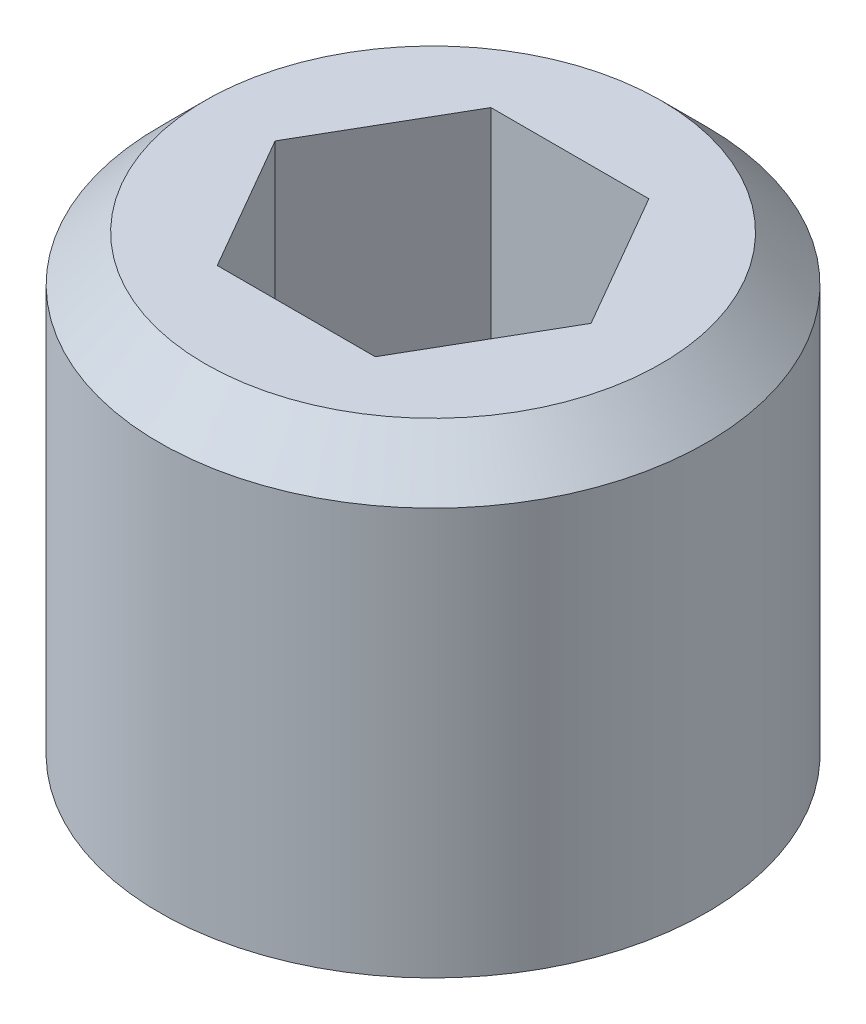
ISO-10303-21;
HEADER;
FILE_DESCRIPTION(('STEP AP214'),'2;1');
FILE_NAME('part.step','',(''),(''),'','','');
FILE_SCHEMA(('AUTOMOTIVE_DESIGN { 1 0 10303 214 1 1 1 1 }'));
ENDSEC;
DATA;
#1=APPLICATION_CONTEXT('core data for automotive mechanical design processes');
#2=APPLICATION_PROTOCOL_DEFINITION('international standard','automotive_design',2000,#1);
#3=PRODUCT_CONTEXT('',#1,'mechanical');
#4=PRODUCT('Part','Part','',(#3));
#5=PRODUCT_RELATED_PRODUCT_CATEGORY('part','',(#4));
#6=PRODUCT_DEFINITION_FORMATION('','',#4);
#7=PRODUCT_DEFINITION_CONTEXT('part definition',#1,'design');
#8=PRODUCT_DEFINITION('design','',#6,#7);
#9=PRODUCT_DEFINITION_SHAPE('','',#8);
#10=(LENGTH_UNIT() NAMED_UNIT(*) SI_UNIT(.MILLI.,.METRE.));
#11=(NAMED_UNIT(*) PLANE_ANGLE_UNIT() SI_UNIT($,.RADIAN.));
#12=(NAMED_UNIT(*) SI_UNIT($,.STERADIAN.) SOLID_ANGLE_UNIT());
#13=UNCERTAINTY_MEASURE_WITH_UNIT(LENGTH_MEASURE(1.E-05),#10,'distance_accuracy_value','');
#14=(GEOMETRIC_REPRESENTATION_CONTEXT(3) GLOBAL_UNCERTAINTY_ASSIGNED_CONTEXT((#13)) GLOBAL_UNIT_ASSIGNED_CONTEXT((#10,
#11,#12)) REPRESENTATION_CONTEXT('',''));
#15=CARTESIAN_POINT('',(0.,0.,0.));
#16=DIRECTION('',(0.,0.,1.));
#17=DIRECTION('',(1.,0.,0.));
#18=AXIS2_PLACEMENT_3D('',#15,#16,#17);
#19=CARTESIAN_POINT('',(0.,3.,0.));
#20=DIRECTION('',(0.,1.,0.));
#21=DIRECTION('',(0.,0.,1.));
#22=AXIS2_PLACEMENT_3D('',#19,#20,#21);
#23=PLANE('',#22);
#24=DIRECTION('',(1.,0.,0.));
#25=VECTOR('',#24,1.);
#26=CARTESIAN_POINT('',(-0.43301270189222,3.,0.75));
#27=LINE('',#26,#25);
#28=CARTESIAN_POINT('',(-0.43301270189222,3.,0.75));
#29=VERTEX_POINT('',#28);
#30=CARTESIAN_POINT('',(0.43301270189222,3.,0.75));
#31=VERTEX_POINT('',#30);
#32=EDGE_CURVE('E44',#29,#31,#27,.T.);
#33=ORIENTED_EDGE('',*,*,#32,.F.);
#34=DIRECTION('',(0.5,0.,0.866025403784439));
#35=VECTOR('',#34,1.);
#36=CARTESIAN_POINT('',(-0.866025403784439,3.,0.));
#37=LINE('',#36,#35);
#38=CARTESIAN_POINT('',(-0.866025403784439,3.,0.));
#39=VERTEX_POINT('',#38);
#40=EDGE_CURVE('E112',#39,#29,#37,.T.);
#41=ORIENTED_EDGE('',*,*,#40,.F.);
#42=DIRECTION('',(-0.5,0.,0.866025403784439));
#43=VECTOR('',#42,1.);
#44=CARTESIAN_POINT('',(-0.433012701892219,3.,-0.75));
#45=LINE('',#44,#43);
#46=CARTESIAN_POINT('',(-0.433012701892219,3.,-0.75));
#47=VERTEX_POINT('',#46);
#48=EDGE_CURVE('E106',#47,#39,#45,.T.);
#49=ORIENTED_EDGE('',*,*,#48,.F.);
#50=DIRECTION('',(-1.,0.,0.));
#51=VECTOR('',#50,1.);
#52=CARTESIAN_POINT('',(0.43301270189222,3.,-0.75));
#53=LINE('',#52,#51);
#54=CARTESIAN_POINT('',(0.43301270189222,3.,-0.75));
#55=VERTEX_POINT('',#54);
#56=EDGE_CURVE('E104',#55,#47,#53,.T.);
#57=ORIENTED_EDGE('',*,*,#56,.F.);
#58=DIRECTION('',(-0.5,0.,-0.866025403784439));
#59=VECTOR('',#58,1.);
#60=CARTESIAN_POINT('',(0.866025403784439,3.,0.));
#61=LINE('',#60,#59);
#62=CARTESIAN_POINT('',(0.866025403784439,3.,0.));
#63=VERTEX_POINT('',#62);
#64=EDGE_CURVE('E86',#63,#55,#61,.T.);
#65=ORIENTED_EDGE('',*,*,#64,.F.);
#66=DIRECTION('',(0.5,0.,-0.866025403784439));
#67=VECTOR('',#66,1.);
#68=CARTESIAN_POINT('',(0.43301270189222,3.,0.75));
#69=LINE('',#68,#67);
#70=EDGE_CURVE('E97',#31,#63,#69,.T.);
#71=ORIENTED_EDGE('',*,*,#70,.F.);
#72=EDGE_LOOP('',(#33,#41,#49,#57,#65,#71));
#73=FACE_BOUND('',#72,.T.);
#74=CARTESIAN_POINT('',(0.,3.,0.));
#75=DIRECTION('',(0.,-1.,0.));
#76=DIRECTION('',(0.,0.,-1.));
#77=AXIS2_PLACEMENT_3D('',#74,#75,#76);
#78=CIRCLE('',#77,1.25);
#79=CARTESIAN_POINT('',(0.,3.,-1.25));
#80=VERTEX_POINT('',#79);
#81=EDGE_CURVE('E132',#80,#80,#78,.T.);
#82=ORIENTED_EDGE('',*,*,#81,.F.);
#83=EDGE_LOOP('',(#82));
#84=FACE_BOUND('',#83,.T.);
#85=ADVANCED_FACE('F30',(#73,#84),#23,.T.);
#86=CARTESIAN_POINT('',(0.,0.34641016151377,0.));
#87=DIRECTION('',(0.,-1.,0.));
#88=DIRECTION('',(0.,0.,-1.));
#89=AXIS2_PLACEMENT_3D('',#86,#87,#88);
#90=CONICAL_SURFACE('',#89,0.,1.0471975511966);
#91=CARTESIAN_POINT('',(0.,0.,0.));
#92=DIRECTION('',(0.,-1.,0.));
#93=DIRECTION('',(0.,0.,-1.));
#94=AXIS2_PLACEMENT_3D('',#91,#92,#93);
#95=CIRCLE('',#94,0.6);
#96=CARTESIAN_POINT('',(0.,0.,-0.6));
#97=VERTEX_POINT('',#96);
#98=EDGE_CURVE('E11',#97,#97,#95,.T.);
#99=ORIENTED_EDGE('',*,*,#98,.T.);
#100=EDGE_LOOP('',(#99));
#101=FACE_BOUND('',#100,.T.);
#102=CARTESIAN_POINT('',(0.,0.346410161513771,0.));
#103=VERTEX_POINT('',#102);
#104=VERTEX_LOOP('',#103);
#105=FACE_BOUND('',#104,.T.);
#106=ADVANCED_FACE('F161',(#101,#105),#90,.F.);
#107=CARTESIAN_POINT('',(0.,0.,0.));
#108=DIRECTION('',(0.,1.,0.));
#109=DIRECTION('',(0.,0.,1.));
#110=AXIS2_PLACEMENT_3D('',#107,#108,#109);
#111=CONICAL_SURFACE('',#110,0.6,1.04719755119659);
#112=CARTESIAN_POINT('',(0.,0.519615242270669,0.));
#113=DIRECTION('',(0.,-1.,0.));
#114=DIRECTION('',(0.,0.,-1.));
#115=AXIS2_PLACEMENT_3D('',#112,#113,#114);
#116=CIRCLE('',#115,1.5);
#117=CARTESIAN_POINT('',(0.,0.519615242270669,-1.5));
#118=VERTEX_POINT('',#117);
#119=EDGE_CURVE('E37',#118,#118,#116,.T.);
#120=ORIENTED_EDGE('',*,*,#119,.T.);
#121=EDGE_LOOP('',(#120));
#122=FACE_BOUND('',#121,.T.);
#123=ORIENTED_EDGE('',*,*,#98,.F.);
#124=EDGE_LOOP('',(#123));
#125=FACE_BOUND('',#124,.T.);
#126=ADVANCED_FACE('F146',(#122,#125),#111,.T.);
#127=CARTESIAN_POINT('',(0.,3.,0.));
#128=DIRECTION('',(0.,-1.,0.));
#129=DIRECTION('',(0.,0.,-1.));
#130=AXIS2_PLACEMENT_3D('',#127,#128,#129);
#131=CYLINDRICAL_SURFACE('',#130,1.5);
#132=CARTESIAN_POINT('',(0.,2.75,0.));
#133=DIRECTION('',(0.,-1.,0.));
#134=DIRECTION('',(0.,0.,-1.));
#135=AXIS2_PLACEMENT_3D('',#132,#133,#134);
#136=CIRCLE('',#135,1.5);
#137=CARTESIAN_POINT('',(0.,2.75,-1.5));
#138=VERTEX_POINT('',#137);
#139=EDGE_CURVE('E141',#138,#138,#136,.T.);
#140=ORIENTED_EDGE('',*,*,#139,.T.);
#141=EDGE_LOOP('',(#140));
#142=FACE_BOUND('',#141,.T.);
#143=ORIENTED_EDGE('',*,*,#119,.F.);
#144=EDGE_LOOP('',(#143));
#145=FACE_BOUND('',#144,.T.);
#146=ADVANCED_FACE('F149',(#142,#145),#131,.T.);
#147=CARTESIAN_POINT('',(0.,2.75,0.));
#148=DIRECTION('',(0.,-1.,0.));
#149=DIRECTION('',(0.,0.,-1.));
#150=AXIS2_PLACEMENT_3D('',#147,#148,#149);
#151=CONICAL_SURFACE('',#150,1.5,0.785398163397448);
#152=ORIENTED_EDGE('',*,*,#81,.T.);
#153=EDGE_LOOP('',(#152));
#154=FACE_BOUND('',#153,.T.);
#155=ORIENTED_EDGE('',*,*,#139,.F.);
#156=EDGE_LOOP('',(#155));
#157=FACE_BOUND('',#156,.T.);
#158=ADVANCED_FACE('F151',(#154,#157),#151,.T.);
#159=CARTESIAN_POINT('',(-0.43301270189222,1.,0.75));
#160=DIRECTION('',(0.,0.,1.));
#161=DIRECTION('',(1.,0.,0.));
#162=AXIS2_PLACEMENT_3D('',#159,#160,#161);
#163=PLANE('',#162);
#164=ORIENTED_EDGE('',*,*,#32,.T.);
#165=DIRECTION('',(0.,1.,0.));
#166=VECTOR('',#165,1.);
#167=CARTESIAN_POINT('',(0.43301270189222,1.,0.75));
#168=LINE('',#167,#166);
#169=CARTESIAN_POINT('',(0.43301270189222,1.,0.75));
#170=VERTEX_POINT('',#169);
#171=EDGE_CURVE('E94',#170,#31,#168,.T.);
#172=ORIENTED_EDGE('',*,*,#171,.F.);
#173=DIRECTION('',(1.,0.,0.));
#174=VECTOR('',#173,1.);
#175=CARTESIAN_POINT('',(-0.43301270189222,1.,0.75));
#176=LINE('',#175,#174);
#177=CARTESIAN_POINT('',(-0.43301270189222,1.,0.75));
#178=VERTEX_POINT('',#177);
#179=EDGE_CURVE('E115',#178,#170,#176,.T.);
#180=ORIENTED_EDGE('',*,*,#179,.F.);
#181=DIRECTION('',(0.,1.,0.));
#182=VECTOR('',#181,1.);
#183=CARTESIAN_POINT('',(-0.43301270189222,1.,0.75));
#184=LINE('',#183,#182);
#185=EDGE_CURVE('E130',#178,#29,#184,.T.);
#186=ORIENTED_EDGE('',*,*,#185,.T.);
#187=EDGE_LOOP('',(#164,#172,#180,#186));
#188=FACE_BOUND('',#187,.T.);
#189=ADVANCED_FACE('F158',(#188),#163,.F.);
#190=CARTESIAN_POINT('',(-0.866025403784439,1.,0.));
#191=DIRECTION('',(-0.866025403784439,0.,0.5));
#192=DIRECTION('',(0.5,0.,0.866025403784439));
#193=AXIS2_PLACEMENT_3D('',#190,#191,#192);
#194=PLANE('',#193);
#195=ORIENTED_EDGE('',*,*,#40,.T.);
#196=ORIENTED_EDGE('',*,*,#185,.F.);
#197=DIRECTION('',(0.5,0.,0.866025403784439));
#198=VECTOR('',#197,1.);
#199=CARTESIAN_POINT('',(-0.866025403784439,1.,0.));
#200=LINE('',#199,#198);
#201=CARTESIAN_POINT('',(-0.866025403784439,1.,0.));
#202=VERTEX_POINT('',#201);
#203=EDGE_CURVE('E127',#202,#178,#200,.T.);
#204=ORIENTED_EDGE('',*,*,#203,.F.);
#205=DIRECTION('',(0.,1.,0.));
#206=VECTOR('',#205,1.);
#207=CARTESIAN_POINT('',(-0.866025403784439,1.,0.));
#208=LINE('',#207,#206);
#209=EDGE_CURVE('E133',#202,#39,#208,.T.);
#210=ORIENTED_EDGE('',*,*,#209,.T.);
#211=EDGE_LOOP('',(#195,#196,#204,#210));
#212=FACE_BOUND('',#211,.T.);
#213=ADVANCED_FACE('F198',(#212),#194,.F.);
#214=CARTESIAN_POINT('',(-0.433012701892219,1.,-0.75));
#215=DIRECTION('',(-0.866025403784439,0.,-0.5));
#216=DIRECTION('',(-0.5,0.,0.866025403784439));
#217=AXIS2_PLACEMENT_3D('',#214,#215,#216);
#218=PLANE('',#217);
#219=ORIENTED_EDGE('',*,*,#48,.T.);
#220=ORIENTED_EDGE('',*,*,#209,.F.);
#221=DIRECTION('',(-0.5,0.,0.866025403784439));
#222=VECTOR('',#221,1.);
#223=CARTESIAN_POINT('',(-0.433012701892219,1.,-0.75));
#224=LINE('',#223,#222);
#225=CARTESIAN_POINT('',(-0.433012701892219,1.,-0.75));
#226=VERTEX_POINT('',#225);
#227=EDGE_CURVE('E124',#226,#202,#224,.T.);
#228=ORIENTED_EDGE('',*,*,#227,.F.);
#229=DIRECTION('',(0.,1.,0.));
#230=VECTOR('',#229,1.);
#231=CARTESIAN_POINT('',(-0.433012701892219,1.,-0.75));
#232=LINE('',#231,#230);
#233=EDGE_CURVE('E135',#226,#47,#232,.T.);
#234=ORIENTED_EDGE('',*,*,#233,.T.);
#235=EDGE_LOOP('',(#219,#220,#228,#234));
#236=FACE_BOUND('',#235,.T.);
#237=ADVANCED_FACE('F207',(#236),#218,.F.);
#238=CARTESIAN_POINT('',(0.43301270189222,1.,-0.75));
#239=DIRECTION('',(0.,0.,-1.));
#240=DIRECTION('',(-1.,0.,0.));
#241=AXIS2_PLACEMENT_3D('',#238,#239,#240);
#242=PLANE('',#241);
#243=ORIENTED_EDGE('',*,*,#56,.T.);
#244=ORIENTED_EDGE('',*,*,#233,.F.);
#245=DIRECTION('',(-1.,0.,0.));
#246=VECTOR('',#245,1.);
#247=CARTESIAN_POINT('',(0.43301270189222,1.,-0.75));
#248=LINE('',#247,#246);
#249=CARTESIAN_POINT('',(0.43301270189222,1.,-0.75));
#250=VERTEX_POINT('',#249);
#251=EDGE_CURVE('E121',#250,#226,#248,.T.);
#252=ORIENTED_EDGE('',*,*,#251,.F.);
#253=DIRECTION('',(0.,1.,0.));
#254=VECTOR('',#253,1.);
#255=CARTESIAN_POINT('',(0.43301270189222,1.,-0.75));
#256=LINE('',#255,#254);
#257=EDGE_CURVE('E93',#250,#55,#256,.T.);
#258=ORIENTED_EDGE('',*,*,#257,.T.);
#259=EDGE_LOOP('',(#243,#244,#252,#258));
#260=FACE_BOUND('',#259,.T.);
#261=ADVANCED_FACE('F217',(#260),#242,.F.);
#262=CARTESIAN_POINT('',(0.866025403784439,1.,0.));
#263=DIRECTION('',(0.866025403784439,0.,-0.5));
#264=DIRECTION('',(-0.5,0.,-0.866025403784439));
#265=AXIS2_PLACEMENT_3D('',#262,#263,#264);
#266=PLANE('',#265);
#267=ORIENTED_EDGE('',*,*,#64,.T.);
#268=ORIENTED_EDGE('',*,*,#257,.F.);
#269=DIRECTION('',(-0.5,0.,-0.866025403784439));
#270=VECTOR('',#269,1.);
#271=CARTESIAN_POINT('',(0.866025403784439,1.,0.));
#272=LINE('',#271,#270);
#273=CARTESIAN_POINT('',(0.866025403784439,1.,0.));
#274=VERTEX_POINT('',#273);
#275=EDGE_CURVE('E89',#274,#250,#272,.T.);
#276=ORIENTED_EDGE('',*,*,#275,.F.);
#277=DIRECTION('',(0.,1.,0.));
#278=VECTOR('',#277,1.);
#279=CARTESIAN_POINT('',(0.866025403784439,1.,0.));
#280=LINE('',#279,#278);
#281=EDGE_CURVE('E82',#274,#63,#280,.T.);
#282=ORIENTED_EDGE('',*,*,#281,.T.);
#283=EDGE_LOOP('',(#267,#268,#276,#282));
#284=FACE_BOUND('',#283,.T.);
#285=ADVANCED_FACE('F84',(#284),#266,.F.);
#286=CARTESIAN_POINT('',(0.43301270189222,1.,0.75));
#287=DIRECTION('',(0.866025403784439,0.,0.5));
#288=DIRECTION('',(0.5,0.,-0.866025403784439));
#289=AXIS2_PLACEMENT_3D('',#286,#287,#288);
#290=PLANE('',#289);
#291=ORIENTED_EDGE('',*,*,#70,.T.);
#292=ORIENTED_EDGE('',*,*,#281,.F.);
#293=DIRECTION('',(0.5,0.,-0.866025403784439));
#294=VECTOR('',#293,1.);
#295=CARTESIAN_POINT('',(0.43301270189222,1.,0.75));
#296=LINE('',#295,#294);
#297=EDGE_CURVE('E118',#170,#274,#296,.T.);
#298=ORIENTED_EDGE('',*,*,#297,.F.);
#299=ORIENTED_EDGE('',*,*,#171,.T.);
#300=EDGE_LOOP('',(#291,#292,#298,#299));
#301=FACE_BOUND('',#300,.T.);
#302=ADVANCED_FACE('F98',(#301),#290,.F.);
#303=CARTESIAN_POINT('',(1.29903810567666,1.,0.75));
#304=DIRECTION('',(0.,1.,0.));
#305=DIRECTION('',(0.,0.,1.));
#306=AXIS2_PLACEMENT_3D('',#303,#304,#305);
#307=PLANE('',#306);
#308=ORIENTED_EDGE('',*,*,#179,.T.);
#309=ORIENTED_EDGE('',*,*,#297,.T.);
#310=ORIENTED_EDGE('',*,*,#275,.T.);
#311=ORIENTED_EDGE('',*,*,#251,.T.);
#312=ORIENTED_EDGE('',*,*,#227,.T.);
#313=ORIENTED_EDGE('',*,*,#203,.T.);
#314=EDGE_LOOP('',(#308,#309,#310,#311,#312,#313));
#315=FACE_BOUND('',#314,.T.);
#316=ADVANCED_FACE('F244',(#315),#307,.T.);
#317=CLOSED_SHELL('',(#85,#106,#126,#146,#158,#189,#213,#237,#261,#285,#302,#316));
#318=MANIFOLD_SOLID_BREP('B2',#317);
#319=ADVANCED_BREP_SHAPE_REPRESENTATION('',(#18,#318),#14);
#320=SHAPE_DEFINITION_REPRESENTATION(#9,#319);
ENDSEC;
END-ISO-10303-21;
